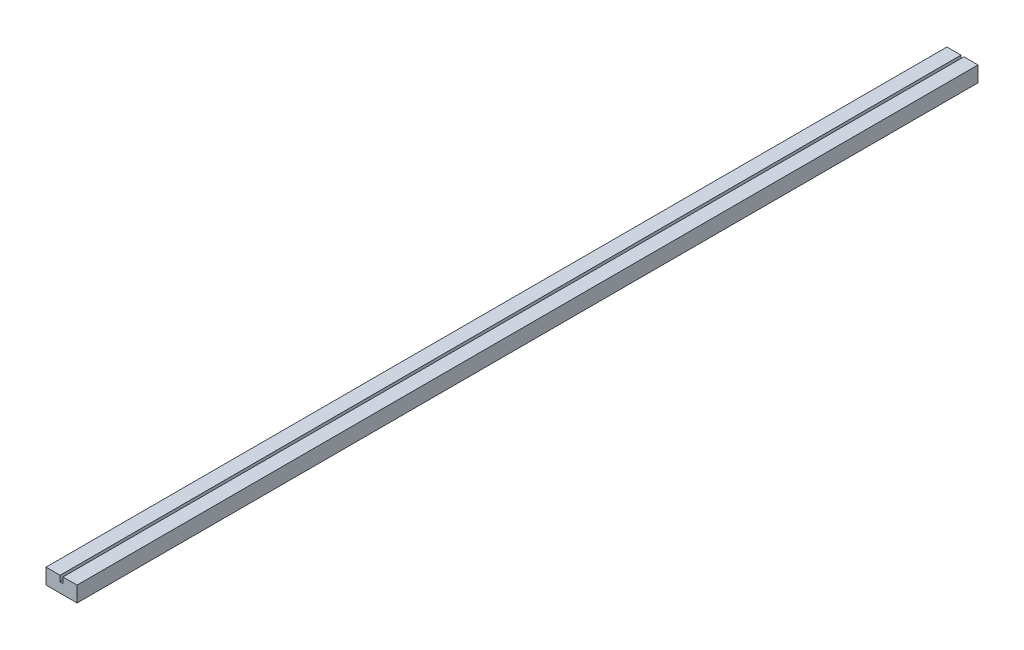
ISO-10303-21;
HEADER;
FILE_DESCRIPTION(('STEP AP214'),'2;1');
FILE_NAME('part.step','',(''),(''),'','','');
FILE_SCHEMA(('AUTOMOTIVE_DESIGN { 1 0 10303 214 1 1 1 1 }'));
ENDSEC;
DATA;
#1=APPLICATION_CONTEXT('core data for automotive mechanical design processes');
#2=APPLICATION_PROTOCOL_DEFINITION('international standard','automotive_design',2000,#1);
#3=PRODUCT_CONTEXT('',#1,'mechanical');
#4=PRODUCT('Part','Part','',(#3));
#5=PRODUCT_RELATED_PRODUCT_CATEGORY('part','',(#4));
#6=PRODUCT_DEFINITION_FORMATION('','',#4);
#7=PRODUCT_DEFINITION_CONTEXT('part definition',#1,'design');
#8=PRODUCT_DEFINITION('design','',#6,#7);
#9=PRODUCT_DEFINITION_SHAPE('','',#8);
#10=(LENGTH_UNIT() NAMED_UNIT(*) SI_UNIT(.MILLI.,.METRE.));
#11=(NAMED_UNIT(*) PLANE_ANGLE_UNIT() SI_UNIT($,.RADIAN.));
#12=(NAMED_UNIT(*) SI_UNIT($,.STERADIAN.) SOLID_ANGLE_UNIT());
#13=UNCERTAINTY_MEASURE_WITH_UNIT(LENGTH_MEASURE(1.E-05),#10,'distance_accuracy_value','');
#14=(GEOMETRIC_REPRESENTATION_CONTEXT(3) GLOBAL_UNCERTAINTY_ASSIGNED_CONTEXT((#13)) GLOBAL_UNIT_ASSIGNED_CONTEXT((#10,
#11,#12)) REPRESENTATION_CONTEXT('',''));
#15=CARTESIAN_POINT('',(0.,0.,0.));
#16=DIRECTION('',(0.,0.,1.));
#17=DIRECTION('',(1.,0.,0.));
#18=AXIS2_PLACEMENT_3D('',#15,#16,#17);
#19=CARTESIAN_POINT('',(0.,50.8,2946.4));
#20=DIRECTION('',(0.,-1.,0.));
#21=DIRECTION('',(0.,0.,-1.));
#22=AXIS2_PLACEMENT_3D('',#19,#20,#21);
#23=PLANE('',#22);
#24=DIRECTION('',(-1.,0.,0.));
#25=VECTOR('',#24,1.);
#26=CARTESIAN_POINT('',(0.,50.8,2946.4));
#27=LINE('',#26,#25);
#28=CARTESIAN_POINT('',(46.0375,50.8,2946.4));
#29=VERTEX_POINT('',#28);
#30=CARTESIAN_POINT('',(0.,50.8,2946.4));
#31=VERTEX_POINT('',#30);
#32=EDGE_CURVE('E136',#29,#31,#27,.T.);
#33=ORIENTED_EDGE('',*,*,#32,.F.);
#34=DIRECTION('',(0.,0.,1.));
#35=VECTOR('',#34,1.);
#36=CARTESIAN_POINT('',(46.0375,50.8,2946.4));
#37=LINE('',#36,#35);
#38=CARTESIAN_POINT('',(46.0375,50.8,0.));
#39=VERTEX_POINT('',#38);
#40=EDGE_CURVE('E121',#39,#29,#37,.T.);
#41=ORIENTED_EDGE('',*,*,#40,.F.);
#42=DIRECTION('',(-1.,0.,0.));
#43=VECTOR('',#42,1.);
#44=CARTESIAN_POINT('',(0.,50.8,0.));
#45=LINE('',#44,#43);
#46=CARTESIAN_POINT('',(0.,50.8,0.));
#47=VERTEX_POINT('',#46);
#48=EDGE_CURVE('E146',#39,#47,#45,.T.);
#49=ORIENTED_EDGE('',*,*,#48,.T.);
#50=DIRECTION('',(0.,0.,-1.));
#51=VECTOR('',#50,1.);
#52=CARTESIAN_POINT('',(0.,50.8,2946.4));
#53=LINE('',#52,#51);
#54=EDGE_CURVE('E152',#31,#47,#53,.T.);
#55=ORIENTED_EDGE('',*,*,#54,.F.);
#56=EDGE_LOOP('',(#33,#41,#49,#55));
#57=FACE_BOUND('',#56,.T.);
#58=ADVANCED_FACE('F33',(#57),#23,.F.);
#59=CARTESIAN_POINT('',(101.6,0.,2946.4));
#60=DIRECTION('',(0.,1.,0.));
#61=DIRECTION('',(-1.,0.,0.));
#62=AXIS2_PLACEMENT_3D('',#59,#60,#61);
#63=PLANE('',#62);
#64=DIRECTION('',(1.,0.,0.));
#65=VECTOR('',#64,1.);
#66=CARTESIAN_POINT('',(101.6,0.,0.));
#67=LINE('',#66,#65);
#68=CARTESIAN_POINT('',(0.,0.,0.));
#69=VERTEX_POINT('',#68);
#70=CARTESIAN_POINT('',(101.6,0.,0.));
#71=VERTEX_POINT('',#70);
#72=EDGE_CURVE('E140',#69,#71,#67,.T.);
#73=ORIENTED_EDGE('',*,*,#72,.T.);
#74=DIRECTION('',(0.,0.,-1.));
#75=VECTOR('',#74,1.);
#76=CARTESIAN_POINT('',(101.6,0.,2946.4));
#77=LINE('',#76,#75);
#78=CARTESIAN_POINT('',(101.6,0.,2946.4));
#79=VERTEX_POINT('',#78);
#80=EDGE_CURVE('E11',#79,#71,#77,.T.);
#81=ORIENTED_EDGE('',*,*,#80,.F.);
#82=DIRECTION('',(1.,0.,0.));
#83=VECTOR('',#82,1.);
#84=CARTESIAN_POINT('',(101.6,0.,2946.4));
#85=LINE('',#84,#83);
#86=CARTESIAN_POINT('',(0.,0.,2946.4));
#87=VERTEX_POINT('',#86);
#88=EDGE_CURVE('E133',#87,#79,#85,.T.);
#89=ORIENTED_EDGE('',*,*,#88,.F.);
#90=DIRECTION('',(0.,0.,-1.));
#91=VECTOR('',#90,1.);
#92=CARTESIAN_POINT('',(0.,0.,2946.4));
#93=LINE('',#92,#91);
#94=EDGE_CURVE('E139',#87,#69,#93,.T.);
#95=ORIENTED_EDGE('',*,*,#94,.T.);
#96=EDGE_LOOP('',(#73,#81,#89,#95));
#97=FACE_BOUND('',#96,.T.);
#98=ADVANCED_FACE('F35',(#97),#63,.F.);
#99=CARTESIAN_POINT('',(101.6,50.8,2946.4));
#100=DIRECTION('',(-1.,0.,0.));
#101=DIRECTION('',(0.,0.,1.));
#102=AXIS2_PLACEMENT_3D('',#99,#100,#101);
#103=PLANE('',#102);
#104=DIRECTION('',(0.,1.,0.));
#105=VECTOR('',#104,1.);
#106=CARTESIAN_POINT('',(101.6,50.8,0.));
#107=LINE('',#106,#105);
#108=CARTESIAN_POINT('',(101.6,50.8,0.));
#109=VERTEX_POINT('',#108);
#110=EDGE_CURVE('E143',#71,#109,#107,.T.);
#111=ORIENTED_EDGE('',*,*,#110,.T.);
#112=DIRECTION('',(0.,0.,-1.));
#113=VECTOR('',#112,1.);
#114=CARTESIAN_POINT('',(101.6,50.8,2946.4));
#115=LINE('',#114,#113);
#116=CARTESIAN_POINT('',(101.6,50.8,2946.4));
#117=VERTEX_POINT('',#116);
#118=EDGE_CURVE('E41',#117,#109,#115,.T.);
#119=ORIENTED_EDGE('',*,*,#118,.F.);
#120=DIRECTION('',(0.,1.,0.));
#121=VECTOR('',#120,1.);
#122=CARTESIAN_POINT('',(101.6,50.8,2946.4));
#123=LINE('',#122,#121);
#124=EDGE_CURVE('E85',#79,#117,#123,.T.);
#125=ORIENTED_EDGE('',*,*,#124,.F.);
#126=ORIENTED_EDGE('',*,*,#80,.T.);
#127=EDGE_LOOP('',(#111,#119,#125,#126));
#128=FACE_BOUND('',#127,.T.);
#129=ADVANCED_FACE('F186',(#128),#103,.F.);
#130=CARTESIAN_POINT('',(55.5625,50.8,0.));
#131=VERTEX_POINT('',#130);
#132=EDGE_CURVE('E147',#109,#131,#45,.T.);
#133=ORIENTED_EDGE('',*,*,#132,.T.);
#134=DIRECTION('',(0.,0.,-1.));
#135=VECTOR('',#134,1.);
#136=CARTESIAN_POINT('',(55.5625,50.8,0.));
#137=LINE('',#136,#135);
#138=CARTESIAN_POINT('',(55.5625,50.8,2946.4));
#139=VERTEX_POINT('',#138);
#140=EDGE_CURVE('E164',#139,#131,#137,.T.);
#141=ORIENTED_EDGE('',*,*,#140,.F.);
#142=EDGE_CURVE('E126',#117,#139,#27,.T.);
#143=ORIENTED_EDGE('',*,*,#142,.F.);
#144=ORIENTED_EDGE('',*,*,#118,.T.);
#145=EDGE_LOOP('',(#133,#141,#143,#144));
#146=FACE_BOUND('',#145,.T.);
#147=ADVANCED_FACE('F156',(#146),#23,.F.);
#148=CARTESIAN_POINT('',(0.,0.,2946.4));
#149=DIRECTION('',(1.,0.,0.));
#150=DIRECTION('',(0.,0.,-1.));
#151=AXIS2_PLACEMENT_3D('',#148,#149,#150);
#152=PLANE('',#151);
#153=DIRECTION('',(0.,-1.,0.));
#154=VECTOR('',#153,1.);
#155=CARTESIAN_POINT('',(0.,0.,0.));
#156=LINE('',#155,#154);
#157=EDGE_CURVE('E78',#47,#69,#156,.T.);
#158=ORIENTED_EDGE('',*,*,#157,.T.);
#159=ORIENTED_EDGE('',*,*,#94,.F.);
#160=DIRECTION('',(0.,-1.,0.));
#161=VECTOR('',#160,1.);
#162=CARTESIAN_POINT('',(0.,0.,2946.4));
#163=LINE('',#162,#161);
#164=EDGE_CURVE('E57',#31,#87,#163,.T.);
#165=ORIENTED_EDGE('',*,*,#164,.F.);
#166=ORIENTED_EDGE('',*,*,#54,.T.);
#167=EDGE_LOOP('',(#158,#159,#165,#166));
#168=FACE_BOUND('',#167,.T.);
#169=ADVANCED_FACE('F176',(#168),#152,.F.);
#170=CARTESIAN_POINT('',(0.,0.,2946.4));
#171=DIRECTION('',(0.,0.,-1.));
#172=DIRECTION('',(-1.,0.,0.));
#173=AXIS2_PLACEMENT_3D('',#170,#171,#172);
#174=PLANE('',#173);
#175=DIRECTION('',(1.,0.,0.));
#176=VECTOR('',#175,1.);
#177=CARTESIAN_POINT('',(50.8,31.75,2946.4));
#178=LINE('',#177,#176);
#179=CARTESIAN_POINT('',(46.0375,31.75,2946.4));
#180=VERTEX_POINT('',#179);
#181=CARTESIAN_POINT('',(55.5625,31.75,2946.4));
#182=VERTEX_POINT('',#181);
#183=EDGE_CURVE('E114',#180,#182,#178,.T.);
#184=ORIENTED_EDGE('',*,*,#183,.F.);
#185=DIRECTION('',(0.,1.,0.));
#186=VECTOR('',#185,1.);
#187=CARTESIAN_POINT('',(46.0375,31.75,2946.4));
#188=LINE('',#187,#186);
#189=EDGE_CURVE('E144',#180,#29,#188,.T.);
#190=ORIENTED_EDGE('',*,*,#189,.T.);
#191=ORIENTED_EDGE('',*,*,#32,.T.);
#192=ORIENTED_EDGE('',*,*,#164,.T.);
#193=ORIENTED_EDGE('',*,*,#88,.T.);
#194=ORIENTED_EDGE('',*,*,#124,.T.);
#195=ORIENTED_EDGE('',*,*,#142,.T.);
#196=DIRECTION('',(0.,1.,0.));
#197=VECTOR('',#196,1.);
#198=CARTESIAN_POINT('',(55.5625,31.75,2946.4));
#199=LINE('',#198,#197);
#200=EDGE_CURVE('E108',#182,#139,#199,.T.);
#201=ORIENTED_EDGE('',*,*,#200,.F.);
#202=EDGE_LOOP('',(#184,#190,#191,#192,#193,#194,#195,#201));
#203=FACE_BOUND('',#202,.T.);
#204=ADVANCED_FACE('F124',(#203),#174,.F.);
#205=CARTESIAN_POINT('',(0.,0.,0.));
#206=DIRECTION('',(0.,0.,-1.));
#207=DIRECTION('',(-1.,0.,0.));
#208=AXIS2_PLACEMENT_3D('',#205,#206,#207);
#209=PLANE('',#208);
#210=DIRECTION('',(0.,1.,0.));
#211=VECTOR('',#210,1.);
#212=CARTESIAN_POINT('',(46.0375,31.75,0.));
#213=LINE('',#212,#211);
#214=CARTESIAN_POINT('',(46.0375,31.75,0.));
#215=VERTEX_POINT('',#214);
#216=EDGE_CURVE('E128',#215,#39,#213,.T.);
#217=ORIENTED_EDGE('',*,*,#216,.F.);
#218=DIRECTION('',(-1.,0.,0.));
#219=VECTOR('',#218,1.);
#220=CARTESIAN_POINT('',(46.0375,31.75,0.));
#221=LINE('',#220,#219);
#222=CARTESIAN_POINT('',(55.5625,31.75,0.));
#223=VERTEX_POINT('',#222);
#224=EDGE_CURVE('E113',#223,#215,#221,.T.);
#225=ORIENTED_EDGE('',*,*,#224,.F.);
#226=DIRECTION('',(0.,1.,0.));
#227=VECTOR('',#226,1.);
#228=CARTESIAN_POINT('',(55.5625,31.75,0.));
#229=LINE('',#228,#227);
#230=EDGE_CURVE('E111',#223,#131,#229,.T.);
#231=ORIENTED_EDGE('',*,*,#230,.T.);
#232=ORIENTED_EDGE('',*,*,#132,.F.);
#233=ORIENTED_EDGE('',*,*,#110,.F.);
#234=ORIENTED_EDGE('',*,*,#72,.F.);
#235=ORIENTED_EDGE('',*,*,#157,.F.);
#236=ORIENTED_EDGE('',*,*,#48,.F.);
#237=EDGE_LOOP('',(#217,#225,#231,#232,#233,#234,#235,#236));
#238=FACE_BOUND('',#237,.T.);
#239=ADVANCED_FACE('F159',(#238),#209,.T.);
#240=CARTESIAN_POINT('',(46.0375,31.75,2946.4));
#241=DIRECTION('',(-1.,0.,0.));
#242=DIRECTION('',(0.,0.,1.));
#243=AXIS2_PLACEMENT_3D('',#240,#241,#242);
#244=PLANE('',#243);
#245=ORIENTED_EDGE('',*,*,#40,.T.);
#246=ORIENTED_EDGE('',*,*,#189,.F.);
#247=DIRECTION('',(0.,0.,1.));
#248=VECTOR('',#247,1.);
#249=CARTESIAN_POINT('',(46.0375,31.75,2946.4));
#250=LINE('',#249,#248);
#251=EDGE_CURVE('E119',#215,#180,#250,.T.);
#252=ORIENTED_EDGE('',*,*,#251,.F.);
#253=ORIENTED_EDGE('',*,*,#216,.T.);
#254=EDGE_LOOP('',(#245,#246,#252,#253));
#255=FACE_BOUND('',#254,.T.);
#256=ADVANCED_FACE('F169',(#255),#244,.F.);
#257=CARTESIAN_POINT('',(55.5625,31.75,0.));
#258=DIRECTION('',(1.,0.,0.));
#259=DIRECTION('',(0.,0.,-1.));
#260=AXIS2_PLACEMENT_3D('',#257,#258,#259);
#261=PLANE('',#260);
#262=ORIENTED_EDGE('',*,*,#140,.T.);
#263=ORIENTED_EDGE('',*,*,#230,.F.);
#264=DIRECTION('',(0.,0.,-1.));
#265=VECTOR('',#264,1.);
#266=CARTESIAN_POINT('',(55.5625,31.75,0.));
#267=LINE('',#266,#265);
#268=EDGE_CURVE('E48',#182,#223,#267,.T.);
#269=ORIENTED_EDGE('',*,*,#268,.F.);
#270=ORIENTED_EDGE('',*,*,#200,.T.);
#271=EDGE_LOOP('',(#262,#263,#269,#270));
#272=FACE_BOUND('',#271,.T.);
#273=ADVANCED_FACE('F106',(#272),#261,.F.);
#274=CARTESIAN_POINT('',(0.,31.75,0.));
#275=DIRECTION('',(0.,-1.,0.));
#276=DIRECTION('',(0.,0.,-1.));
#277=AXIS2_PLACEMENT_3D('',#274,#275,#276);
#278=PLANE('',#277);
#279=ORIENTED_EDGE('',*,*,#183,.T.);
#280=ORIENTED_EDGE('',*,*,#268,.T.);
#281=ORIENTED_EDGE('',*,*,#224,.T.);
#282=ORIENTED_EDGE('',*,*,#251,.T.);
#283=EDGE_LOOP('',(#279,#280,#281,#282));
#284=FACE_BOUND('',#283,.T.);
#285=ADVANCED_FACE('F118',(#284),#278,.F.);
#286=CLOSED_SHELL('',(#58,#98,#129,#147,#169,#204,#239,#256,#273,#285));
#287=MANIFOLD_SOLID_BREP('B2',#286);
#288=ADVANCED_BREP_SHAPE_REPRESENTATION('',(#18,#287),#14);
#289=SHAPE_DEFINITION_REPRESENTATION(#9,#288);
ENDSEC;
END-ISO-10303-21;
